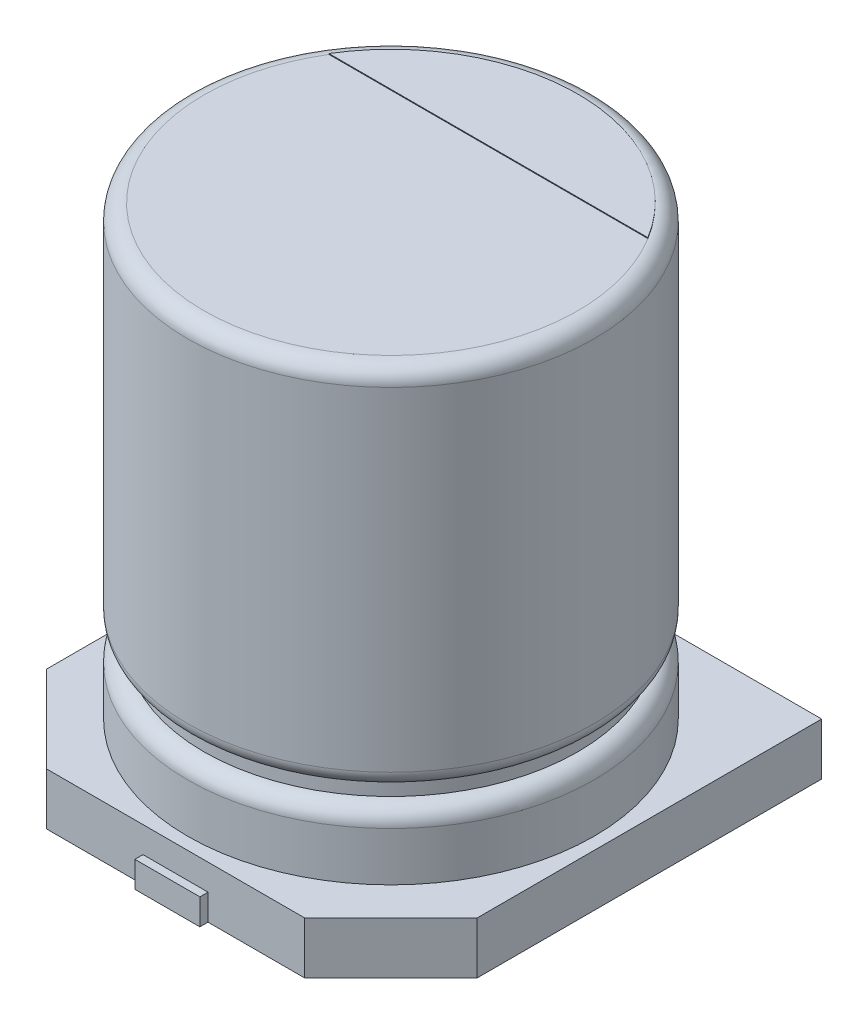
ISO-10303-21;
HEADER;
FILE_DESCRIPTION(('STEP AP214'),'2;1');
FILE_NAME('part.step','',(''),(''),'','','');
FILE_SCHEMA(('AUTOMOTIVE_DESIGN { 1 0 10303 214 1 1 1 1 }'));
ENDSEC;
DATA;
#1=APPLICATION_CONTEXT('core data for automotive mechanical design processes');
#2=APPLICATION_PROTOCOL_DEFINITION('international standard','automotive_design',2000,#1);
#3=PRODUCT_CONTEXT('',#1,'mechanical');
#4=PRODUCT('Part','Part','',(#3));
#5=PRODUCT_RELATED_PRODUCT_CATEGORY('part','',(#4));
#6=PRODUCT_DEFINITION_FORMATION('','',#4);
#7=PRODUCT_DEFINITION_CONTEXT('part definition',#1,'design');
#8=PRODUCT_DEFINITION('design','',#6,#7);
#9=PRODUCT_DEFINITION_SHAPE('','',#8);
#10=(LENGTH_UNIT() NAMED_UNIT(*) SI_UNIT(.MILLI.,.METRE.));
#11=(NAMED_UNIT(*) PLANE_ANGLE_UNIT() SI_UNIT($,.RADIAN.));
#12=(NAMED_UNIT(*) SI_UNIT($,.STERADIAN.) SOLID_ANGLE_UNIT());
#13=UNCERTAINTY_MEASURE_WITH_UNIT(LENGTH_MEASURE(1.E-05),#10,'distance_accuracy_value','');
#14=(GEOMETRIC_REPRESENTATION_CONTEXT(3) GLOBAL_UNCERTAINTY_ASSIGNED_CONTEXT((#13)) GLOBAL_UNIT_ASSIGNED_CONTEXT((#10,
#11,#12)) REPRESENTATION_CONTEXT('',''));
#15=CARTESIAN_POINT('',(0.,0.,0.));
#16=DIRECTION('',(0.,0.,1.));
#17=DIRECTION('',(1.,0.,0.));
#18=AXIS2_PLACEMENT_3D('',#15,#16,#17);
#19=CARTESIAN_POINT('',(0.,-0.64,0.));
#20=DIRECTION('',(0.,-1.,0.));
#21=DIRECTION('',(1.,0.,0.));
#22=AXIS2_PLACEMENT_3D('',#19,#20,#21);
#23=PLANE('',#22);
#24=DIRECTION('',(-1.,0.,0.));
#25=VECTOR('',#24,1.);
#26=CARTESIAN_POINT('',(1.58933982822018,-0.64,2.65));
#27=LINE('',#26,#25);
#28=CARTESIAN_POINT('',(1.58933982822018,-0.64,2.65));
#29=VERTEX_POINT('',#28);
#30=CARTESIAN_POINT('',(0.4,-0.64,2.65));
#31=VERTEX_POINT('',#30);
#32=EDGE_CURVE('E238',#29,#31,#27,.T.);
#33=ORIENTED_EDGE('',*,*,#32,.T.);
#34=DIRECTION('',(0.,0.,-1.));
#35=VECTOR('',#34,1.);
#36=CARTESIAN_POINT('',(0.4,-0.64,0.));
#37=LINE('',#36,#35);
#38=CARTESIAN_POINT('',(0.4,-0.64,0.5));
#39=VERTEX_POINT('',#38);
#40=EDGE_CURVE('E11',#31,#39,#37,.T.);
#41=ORIENTED_EDGE('',*,*,#40,.T.);
#42=DIRECTION('',(-1.,0.,0.));
#43=VECTOR('',#42,1.);
#44=CARTESIAN_POINT('',(0.,-0.64,0.5));
#45=LINE('',#44,#43);
#46=CARTESIAN_POINT('',(-0.4,-0.64,0.5));
#47=VERTEX_POINT('',#46);
#48=EDGE_CURVE('E45',#39,#47,#45,.T.);
#49=ORIENTED_EDGE('',*,*,#48,.T.);
#50=DIRECTION('',(0.,0.,1.));
#51=VECTOR('',#50,1.);
#52=CARTESIAN_POINT('',(-0.4,-0.64,0.));
#53=LINE('',#52,#51);
#54=CARTESIAN_POINT('',(-0.4,-0.64,2.65));
#55=VERTEX_POINT('',#54);
#56=EDGE_CURVE('E317',#47,#55,#53,.T.);
#57=ORIENTED_EDGE('',*,*,#56,.T.);
#58=CARTESIAN_POINT('',(-1.58933982822018,-0.64,2.65));
#59=VERTEX_POINT('',#58);
#60=EDGE_CURVE('E237',#55,#59,#27,.T.);
#61=ORIENTED_EDGE('',*,*,#60,.T.);
#62=DIRECTION('',(-0.707106781186546,0.,-0.707106781186549));
#63=VECTOR('',#62,1.);
#64=CARTESIAN_POINT('',(-1.58933982822018,-0.64,2.65));
#65=LINE('',#64,#63);
#66=CARTESIAN_POINT('',(-2.65,-0.64,1.58933982822018));
#67=VERTEX_POINT('',#66);
#68=EDGE_CURVE('E240',#59,#67,#65,.T.);
#69=ORIENTED_EDGE('',*,*,#68,.T.);
#70=DIRECTION('',(0.,0.,-1.));
#71=VECTOR('',#70,1.);
#72=CARTESIAN_POINT('',(-2.65,-0.64,1.58933982822018));
#73=LINE('',#72,#71);
#74=CARTESIAN_POINT('',(-2.65,-0.64,-2.65));
#75=VERTEX_POINT('',#74);
#76=EDGE_CURVE('E225',#67,#75,#73,.T.);
#77=ORIENTED_EDGE('',*,*,#76,.T.);
#78=DIRECTION('',(1.,0.,0.));
#79=VECTOR('',#78,1.);
#80=CARTESIAN_POINT('',(-2.65,-0.64,-2.65));
#81=LINE('',#80,#79);
#82=CARTESIAN_POINT('',(-0.4,-0.64,-2.65));
#83=VERTEX_POINT('',#82);
#84=EDGE_CURVE('E230',#75,#83,#81,.T.);
#85=ORIENTED_EDGE('',*,*,#84,.T.);
#86=DIRECTION('',(0.,0.,1.));
#87=VECTOR('',#86,1.);
#88=CARTESIAN_POINT('',(-0.4,-0.64,0.));
#89=LINE('',#88,#87);
#90=CARTESIAN_POINT('',(-0.4,-0.64,-0.5));
#91=VERTEX_POINT('',#90);
#92=EDGE_CURVE('E314',#83,#91,#89,.T.);
#93=ORIENTED_EDGE('',*,*,#92,.T.);
#94=DIRECTION('',(1.,0.,0.));
#95=VECTOR('',#94,1.);
#96=CARTESIAN_POINT('',(0.,-0.64,-0.5));
#97=LINE('',#96,#95);
#98=CARTESIAN_POINT('',(0.4,-0.64,-0.5));
#99=VERTEX_POINT('',#98);
#100=EDGE_CURVE('E307',#91,#99,#97,.T.);
#101=ORIENTED_EDGE('',*,*,#100,.T.);
#102=DIRECTION('',(0.,0.,-1.));
#103=VECTOR('',#102,1.);
#104=CARTESIAN_POINT('',(0.4,-0.64,0.));
#105=LINE('',#104,#103);
#106=CARTESIAN_POINT('',(0.4,-0.64,-2.65));
#107=VERTEX_POINT('',#106);
#108=EDGE_CURVE('E311',#99,#107,#105,.T.);
#109=ORIENTED_EDGE('',*,*,#108,.T.);
#110=CARTESIAN_POINT('',(2.65,-0.64,-2.65));
#111=VERTEX_POINT('',#110);
#112=EDGE_CURVE('E228',#107,#111,#81,.T.);
#113=ORIENTED_EDGE('',*,*,#112,.T.);
#114=DIRECTION('',(0.,0.,1.));
#115=VECTOR('',#114,1.);
#116=CARTESIAN_POINT('',(2.65,-0.64,-2.65));
#117=LINE('',#116,#115);
#118=CARTESIAN_POINT('',(2.65,-0.64,1.58933982822018));
#119=VERTEX_POINT('',#118);
#120=EDGE_CURVE('E233',#111,#119,#117,.T.);
#121=ORIENTED_EDGE('',*,*,#120,.T.);
#122=DIRECTION('',(-0.707106781186546,0.,0.707106781186549));
#123=VECTOR('',#122,1.);
#124=CARTESIAN_POINT('',(2.65,-0.64,1.58933982822018));
#125=LINE('',#124,#123);
#126=EDGE_CURVE('E235',#119,#29,#125,.T.);
#127=ORIENTED_EDGE('',*,*,#126,.T.);
#128=EDGE_LOOP('',(#33,#41,#49,#57,#61,#69,#77,#85,#93,#101,#109,#113,#121,#127));
#129=FACE_BOUND('',#128,.T.);
#130=ADVANCED_FACE('F36',(#129),#23,.T.);
#131=ORIENTED_EDGE('',*,*,#40,.F.);
#132=DIRECTION('',(0.,0.,1.));
#133=VECTOR('',#132,1.);
#134=CARTESIAN_POINT('',(0.4,-0.64,0.5));
#135=LINE('',#134,#133);
#136=CARTESIAN_POINT('',(0.4,-0.64,2.75));
#137=VERTEX_POINT('',#136);
#138=EDGE_CURVE('E156',#31,#137,#135,.T.);
#139=ORIENTED_EDGE('',*,*,#138,.T.);
#140=DIRECTION('',(-1.,0.,0.));
#141=VECTOR('',#140,1.);
#142=CARTESIAN_POINT('',(-0.4,-0.64,2.75));
#143=LINE('',#142,#141);
#144=CARTESIAN_POINT('',(-0.4,-0.64,2.75));
#145=VERTEX_POINT('',#144);
#146=EDGE_CURVE('E161',#137,#145,#143,.T.);
#147=ORIENTED_EDGE('',*,*,#146,.T.);
#148=DIRECTION('',(0.,0.,-1.));
#149=VECTOR('',#148,1.);
#150=CARTESIAN_POINT('',(-0.4,-0.64,0.5));
#151=LINE('',#150,#149);
#152=EDGE_CURVE('E180',#145,#55,#151,.T.);
#153=ORIENTED_EDGE('',*,*,#152,.T.);
#154=ORIENTED_EDGE('',*,*,#56,.F.);
#155=ORIENTED_EDGE('',*,*,#48,.F.);
#156=EDGE_LOOP('',(#131,#139,#147,#153,#154,#155));
#157=FACE_BOUND('',#156,.T.);
#158=ADVANCED_FACE('F158',(#157),#23,.T.);
#159=ORIENTED_EDGE('',*,*,#92,.F.);
#160=DIRECTION('',(0.,0.,-1.));
#161=VECTOR('',#160,1.);
#162=CARTESIAN_POINT('',(-0.4,-0.64,-0.5));
#163=LINE('',#162,#161);
#164=CARTESIAN_POINT('',(-0.4,-0.64,-2.75));
#165=VERTEX_POINT('',#164);
#166=EDGE_CURVE('E190',#83,#165,#163,.T.);
#167=ORIENTED_EDGE('',*,*,#166,.T.);
#168=DIRECTION('',(1.,0.,0.));
#169=VECTOR('',#168,1.);
#170=CARTESIAN_POINT('',(-0.4,-0.64,-2.75));
#171=LINE('',#170,#169);
#172=CARTESIAN_POINT('',(0.4,-0.64,-2.75));
#173=VERTEX_POINT('',#172);
#174=EDGE_CURVE('E192',#165,#173,#171,.T.);
#175=ORIENTED_EDGE('',*,*,#174,.T.);
#176=DIRECTION('',(0.,0.,1.));
#177=VECTOR('',#176,1.);
#178=CARTESIAN_POINT('',(0.4,-0.64,-0.5));
#179=LINE('',#178,#177);
#180=EDGE_CURVE('E195',#173,#107,#179,.T.);
#181=ORIENTED_EDGE('',*,*,#180,.T.);
#182=ORIENTED_EDGE('',*,*,#108,.F.);
#183=ORIENTED_EDGE('',*,*,#100,.F.);
#184=EDGE_LOOP('',(#159,#167,#175,#181,#182,#183));
#185=FACE_BOUND('',#184,.T.);
#186=ADVANCED_FACE('F372',(#185),#23,.T.);
#187=CARTESIAN_POINT('',(1.58933982822018,-0.64,2.65));
#188=DIRECTION('',(0.,0.,-1.));
#189=DIRECTION('',(-1.,0.,0.));
#190=AXIS2_PLACEMENT_3D('',#187,#188,#189);
#191=PLANE('',#190);
#192=DIRECTION('',(0.,-1.,0.));
#193=VECTOR('',#192,1.);
#194=CARTESIAN_POINT('',(-0.399999999999999,-0.32,2.65));
#195=LINE('',#194,#193);
#196=CARTESIAN_POINT('',(-0.4,-0.32,2.65));
#197=VERTEX_POINT('',#196);
#198=EDGE_CURVE('E212',#197,#55,#195,.T.);
#199=ORIENTED_EDGE('',*,*,#198,.F.);
#200=DIRECTION('',(-1.,0.,0.));
#201=VECTOR('',#200,1.);
#202=CARTESIAN_POINT('',(0.,-0.32,2.65));
#203=LINE('',#202,#201);
#204=CARTESIAN_POINT('',(0.4,-0.32,2.65));
#205=VERTEX_POINT('',#204);
#206=EDGE_CURVE('E209',#205,#197,#203,.T.);
#207=ORIENTED_EDGE('',*,*,#206,.F.);
#208=DIRECTION('',(0.,-1.,0.));
#209=VECTOR('',#208,1.);
#210=CARTESIAN_POINT('',(0.399999999999999,-0.32,2.65));
#211=LINE('',#210,#209);
#212=EDGE_CURVE('E211',#205,#31,#211,.T.);
#213=ORIENTED_EDGE('',*,*,#212,.T.);
#214=ORIENTED_EDGE('',*,*,#32,.F.);
#215=DIRECTION('',(0.,1.,0.));
#216=VECTOR('',#215,1.);
#217=CARTESIAN_POINT('',(1.58933982822018,-0.64,2.65));
#218=LINE('',#217,#216);
#219=CARTESIAN_POINT('',(1.58933982822018,0.,2.65));
#220=VERTEX_POINT('',#219);
#221=EDGE_CURVE('E259',#29,#220,#218,.T.);
#222=ORIENTED_EDGE('',*,*,#221,.T.);
#223=DIRECTION('',(-1.,0.,0.));
#224=VECTOR('',#223,1.);
#225=CARTESIAN_POINT('',(1.58933982822018,0.,2.65));
#226=LINE('',#225,#224);
#227=CARTESIAN_POINT('',(-1.58933982822018,0.,2.65));
#228=VERTEX_POINT('',#227);
#229=EDGE_CURVE('E251',#220,#228,#226,.T.);
#230=ORIENTED_EDGE('',*,*,#229,.T.);
#231=DIRECTION('',(0.,1.,0.));
#232=VECTOR('',#231,1.);
#233=CARTESIAN_POINT('',(-1.58933982822018,-0.64,2.65));
#234=LINE('',#233,#232);
#235=EDGE_CURVE('E256',#59,#228,#234,.T.);
#236=ORIENTED_EDGE('',*,*,#235,.F.);
#237=ORIENTED_EDGE('',*,*,#60,.F.);
#238=EDGE_LOOP('',(#199,#207,#213,#214,#222,#230,#236,#237));
#239=FACE_BOUND('',#238,.T.);
#240=ADVANCED_FACE('F340',(#239),#191,.F.);
#241=CARTESIAN_POINT('',(-2.65,-0.64,-2.65));
#242=DIRECTION('',(0.,0.,1.));
#243=DIRECTION('',(1.,0.,0.));
#244=AXIS2_PLACEMENT_3D('',#241,#242,#243);
#245=PLANE('',#244);
#246=DIRECTION('',(0.,-1.,0.));
#247=VECTOR('',#246,1.);
#248=CARTESIAN_POINT('',(0.399999999999999,-0.32,-2.65));
#249=LINE('',#248,#247);
#250=CARTESIAN_POINT('',(0.4,-0.32,-2.65));
#251=VERTEX_POINT('',#250);
#252=EDGE_CURVE('E219',#251,#107,#249,.T.);
#253=ORIENTED_EDGE('',*,*,#252,.F.);
#254=DIRECTION('',(1.,0.,0.));
#255=VECTOR('',#254,1.);
#256=CARTESIAN_POINT('',(0.,-0.32,-2.65));
#257=LINE('',#256,#255);
#258=CARTESIAN_POINT('',(-0.4,-0.32,-2.65));
#259=VERTEX_POINT('',#258);
#260=EDGE_CURVE('E215',#259,#251,#257,.T.);
#261=ORIENTED_EDGE('',*,*,#260,.F.);
#262=DIRECTION('',(0.,-1.,0.));
#263=VECTOR('',#262,1.);
#264=CARTESIAN_POINT('',(-0.399999999999999,-0.32,-2.65));
#265=LINE('',#264,#263);
#266=EDGE_CURVE('E218',#259,#83,#265,.T.);
#267=ORIENTED_EDGE('',*,*,#266,.T.);
#268=ORIENTED_EDGE('',*,*,#84,.F.);
#269=DIRECTION('',(0.,1.,0.));
#270=VECTOR('',#269,1.);
#271=CARTESIAN_POINT('',(-2.65,-0.64,-2.65));
#272=LINE('',#271,#270);
#273=CARTESIAN_POINT('',(-2.65,0.,-2.65));
#274=VERTEX_POINT('',#273);
#275=EDGE_CURVE('E268',#75,#274,#272,.T.);
#276=ORIENTED_EDGE('',*,*,#275,.T.);
#277=DIRECTION('',(1.,0.,0.));
#278=VECTOR('',#277,1.);
#279=CARTESIAN_POINT('',(-2.65,0.,-2.65));
#280=LINE('',#279,#278);
#281=CARTESIAN_POINT('',(2.65,0.,-2.65));
#282=VERTEX_POINT('',#281);
#283=EDGE_CURVE('E245',#274,#282,#280,.T.);
#284=ORIENTED_EDGE('',*,*,#283,.T.);
#285=DIRECTION('',(0.,1.,0.));
#286=VECTOR('',#285,1.);
#287=CARTESIAN_POINT('',(2.65,-0.64,-2.65));
#288=LINE('',#287,#286);
#289=EDGE_CURVE('E265',#111,#282,#288,.T.);
#290=ORIENTED_EDGE('',*,*,#289,.F.);
#291=ORIENTED_EDGE('',*,*,#112,.F.);
#292=EDGE_LOOP('',(#253,#261,#267,#268,#276,#284,#290,#291));
#293=FACE_BOUND('',#292,.T.);
#294=ADVANCED_FACE('F354',(#293),#245,.F.);
#295=CARTESIAN_POINT('',(0.,5.5,0.));
#296=DIRECTION('',(0.,1.,0.));
#297=DIRECTION('',(-1.,0.,0.));
#298=AXIS2_PLACEMENT_3D('',#295,#296,#297);
#299=PLANE('',#298);
#300=CARTESIAN_POINT('',(0.,5.5,0.));
#301=DIRECTION('',(0.,1.,0.));
#302=DIRECTION('',(-1.,0.,0.));
#303=AXIS2_PLACEMENT_3D('',#300,#301,#302);
#304=CIRCLE('',#303,2.3);
#305=CARTESIAN_POINT('',(-1.96214168703486,5.5,-1.2));
#306=VERTEX_POINT('',#305);
#307=CARTESIAN_POINT('',(1.96214168703486,5.5,-1.2));
#308=VERTEX_POINT('',#307);
#309=EDGE_CURVE('E303',#306,#308,#304,.T.);
#310=ORIENTED_EDGE('',*,*,#309,.T.);
#311=DIRECTION('',(1.,0.,0.));
#312=VECTOR('',#311,1.);
#313=CARTESIAN_POINT('',(-1.96214168703486,5.5,-1.2));
#314=LINE('',#313,#312);
#315=EDGE_CURVE('E274',#306,#308,#314,.T.);
#316=ORIENTED_EDGE('',*,*,#315,.F.);
#317=EDGE_LOOP('',(#310,#316));
#318=FACE_BOUND('',#317,.T.);
#319=ADVANCED_FACE('F38',(#318),#299,.T.);
#320=CARTESIAN_POINT('',(0.,5.3,0.));
#321=DIRECTION('',(0.,1.,0.));
#322=DIRECTION('',(-1.,0.,0.));
#323=AXIS2_PLACEMENT_3D('',#320,#321,#322);
#324=TOROIDAL_SURFACE('',#323,2.3,0.2);
#325=CARTESIAN_POINT('',(0.,5.3,0.));
#326=DIRECTION('',(0.,1.,0.));
#327=DIRECTION('',(-1.,0.,0.));
#328=AXIS2_PLACEMENT_3D('',#325,#326,#327);
#329=CIRCLE('',#328,2.5);
#330=CARTESIAN_POINT('',(-2.5,5.3,0.));
#331=VERTEX_POINT('',#330);
#332=EDGE_CURVE('E300',#331,#331,#329,.T.);
#333=ORIENTED_EDGE('',*,*,#332,.T.);
#334=EDGE_LOOP('',(#333));
#335=FACE_BOUND('',#334,.T.);
#336=EDGE_CURVE('E304',#308,#306,#304,.T.);
#337=ORIENTED_EDGE('',*,*,#336,.F.);
#338=ORIENTED_EDGE('',*,*,#309,.F.);
#339=EDGE_LOOP('',(#337,#338));
#340=FACE_BOUND('',#339,.T.);
#341=ADVANCED_FACE('F453',(#335,#340),#324,.T.);
#342=CARTESIAN_POINT('',(0.,8.08222988146831,0.));
#343=DIRECTION('',(0.,1.,0.));
#344=DIRECTION('',(-1.,0.,0.));
#345=AXIS2_PLACEMENT_3D('',#342,#343,#344);
#346=CYLINDRICAL_SURFACE('',#345,2.5);
#347=CARTESIAN_POINT('',(0.,1.2,0.));
#348=DIRECTION('',(0.,1.,0.));
#349=DIRECTION('',(-1.,0.,0.));
#350=AXIS2_PLACEMENT_3D('',#347,#348,#349);
#351=CIRCLE('',#350,2.5);
#352=CARTESIAN_POINT('',(-2.5,1.2,0.));
#353=VERTEX_POINT('',#352);
#354=EDGE_CURVE('E297',#353,#353,#351,.T.);
#355=ORIENTED_EDGE('',*,*,#354,.T.);
#356=EDGE_LOOP('',(#355));
#357=FACE_BOUND('',#356,.T.);
#358=ORIENTED_EDGE('',*,*,#332,.F.);
#359=EDGE_LOOP('',(#358));
#360=FACE_BOUND('',#359,.T.);
#361=ADVANCED_FACE('F450',(#357,#360),#346,.T.);
#362=CARTESIAN_POINT('',(0.,1.2,0.));
#363=DIRECTION('',(0.,1.,0.));
#364=DIRECTION('',(-1.,0.,0.));
#365=AXIS2_PLACEMENT_3D('',#362,#363,#364);
#366=TOROIDAL_SURFACE('',#365,2.3,0.2);
#367=CARTESIAN_POINT('',(0.,0.999999999999999,0.));
#368=DIRECTION('',(0.,1.,0.));
#369=DIRECTION('',(-1.,0.,0.));
#370=AXIS2_PLACEMENT_3D('',#367,#368,#369);
#371=CIRCLE('',#370,2.3);
#372=CARTESIAN_POINT('',(-2.3,0.999999999999999,0.));
#373=VERTEX_POINT('',#372);
#374=EDGE_CURVE('E294',#373,#373,#371,.T.);
#375=ORIENTED_EDGE('',*,*,#374,.T.);
#376=EDGE_LOOP('',(#375));
#377=FACE_BOUND('',#376,.T.);
#378=ORIENTED_EDGE('',*,*,#354,.F.);
#379=EDGE_LOOP('',(#378));
#380=FACE_BOUND('',#379,.T.);
#381=ADVANCED_FACE('F446',(#377,#380),#366,.T.);
#382=CARTESIAN_POINT('',(0.,8.08222988146831,0.));
#383=DIRECTION('',(0.,1.,0.));
#384=DIRECTION('',(-1.,0.,0.));
#385=AXIS2_PLACEMENT_3D('',#382,#383,#384);
#386=CYLINDRICAL_SURFACE('',#385,2.3);
#387=CARTESIAN_POINT('',(0.,0.799999999999999,0.));
#388=DIRECTION('',(0.,1.,0.));
#389=DIRECTION('',(-1.,0.,0.));
#390=AXIS2_PLACEMENT_3D('',#387,#388,#389);
#391=CIRCLE('',#390,2.3);
#392=CARTESIAN_POINT('',(-2.3,0.799999999999999,0.));
#393=VERTEX_POINT('',#392);
#394=EDGE_CURVE('E291',#393,#393,#391,.T.);
#395=ORIENTED_EDGE('',*,*,#394,.T.);
#396=EDGE_LOOP('',(#395));
#397=FACE_BOUND('',#396,.T.);
#398=ORIENTED_EDGE('',*,*,#374,.F.);
#399=EDGE_LOOP('',(#398));
#400=FACE_BOUND('',#399,.T.);
#401=ADVANCED_FACE('F442',(#397,#400),#386,.T.);
#402=CARTESIAN_POINT('',(0.,0.599999999999999,0.));
#403=DIRECTION('',(0.,1.,0.));
#404=DIRECTION('',(-1.,0.,0.));
#405=AXIS2_PLACEMENT_3D('',#402,#403,#404);
#406=TOROIDAL_SURFACE('',#405,2.3,0.2);
#407=CARTESIAN_POINT('',(0.,0.6,0.));
#408=DIRECTION('',(0.,1.,0.));
#409=DIRECTION('',(-1.,0.,0.));
#410=AXIS2_PLACEMENT_3D('',#407,#408,#409);
#411=CIRCLE('',#410,2.5);
#412=CARTESIAN_POINT('',(-2.5,0.6,0.));
#413=VERTEX_POINT('',#412);
#414=EDGE_CURVE('E288',#413,#413,#411,.T.);
#415=ORIENTED_EDGE('',*,*,#414,.T.);
#416=EDGE_LOOP('',(#415));
#417=FACE_BOUND('',#416,.T.);
#418=ORIENTED_EDGE('',*,*,#394,.F.);
#419=EDGE_LOOP('',(#418));
#420=FACE_BOUND('',#419,.T.);
#421=ADVANCED_FACE('F438',(#417,#420),#406,.T.);
#422=CARTESIAN_POINT('',(0.,8.08222988146831,0.));
#423=DIRECTION('',(0.,1.,0.));
#424=DIRECTION('',(-1.,0.,0.));
#425=AXIS2_PLACEMENT_3D('',#422,#423,#424);
#426=CYLINDRICAL_SURFACE('',#425,2.5);
#427=CARTESIAN_POINT('',(0.,0.,0.));
#428=DIRECTION('',(0.,-1.,0.));
#429=DIRECTION('',(1.,0.,0.));
#430=AXIS2_PLACEMENT_3D('',#427,#428,#429);
#431=CIRCLE('',#430,2.5);
#432=CARTESIAN_POINT('',(2.5,0.,0.));
#433=VERTEX_POINT('',#432);
#434=EDGE_CURVE('E271',#433,#433,#431,.F.);
#435=ORIENTED_EDGE('',*,*,#434,.T.);
#436=EDGE_LOOP('',(#435));
#437=FACE_BOUND('',#436,.T.);
#438=ORIENTED_EDGE('',*,*,#414,.F.);
#439=EDGE_LOOP('',(#438));
#440=FACE_BOUND('',#439,.T.);
#441=ADVANCED_FACE('F434',(#437,#440),#426,.T.);
#442=CARTESIAN_POINT('',(0.,5.51,0.));
#443=DIRECTION('',(0.,-1.,0.));
#444=DIRECTION('',(1.,0.,0.));
#445=AXIS2_PLACEMENT_3D('',#442,#443,#444);
#446=CYLINDRICAL_SURFACE('',#445,2.3);
#447=ORIENTED_EDGE('',*,*,#336,.T.);
#448=DIRECTION('',(0.,-1.,0.));
#449=VECTOR('',#448,1.);
#450=CARTESIAN_POINT('',(-1.96214168703486,5.51,-1.2));
#451=LINE('',#450,#449);
#452=CARTESIAN_POINT('',(-1.96214168703486,5.51,-1.2));
#453=VERTEX_POINT('',#452);
#454=EDGE_CURVE('E285',#453,#306,#451,.T.);
#455=ORIENTED_EDGE('',*,*,#454,.F.);
#456=CARTESIAN_POINT('',(0.,5.51,0.));
#457=DIRECTION('',(0.,1.,0.));
#458=DIRECTION('',(-1.,0.,0.));
#459=AXIS2_PLACEMENT_3D('',#456,#457,#458);
#460=CIRCLE('',#459,2.3);
#461=CARTESIAN_POINT('',(1.96214168703486,5.51,-1.2));
#462=VERTEX_POINT('',#461);
#463=EDGE_CURVE('E275',#462,#453,#460,.T.);
#464=ORIENTED_EDGE('',*,*,#463,.F.);
#465=DIRECTION('',(0.,-1.,0.));
#466=VECTOR('',#465,1.);
#467=CARTESIAN_POINT('',(1.96214168703486,5.51,-1.2));
#468=LINE('',#467,#466);
#469=EDGE_CURVE('E280',#462,#308,#468,.T.);
#470=ORIENTED_EDGE('',*,*,#469,.T.);
#471=EDGE_LOOP('',(#447,#455,#464,#470));
#472=FACE_BOUND('',#471,.T.);
#473=ADVANCED_FACE('F430',(#472),#446,.T.);
#474=CARTESIAN_POINT('',(-1.96214168703486,5.51,-1.2));
#475=DIRECTION('',(0.,0.,-1.));
#476=DIRECTION('',(-1.,0.,0.));
#477=AXIS2_PLACEMENT_3D('',#474,#475,#476);
#478=PLANE('',#477);
#479=ORIENTED_EDGE('',*,*,#315,.T.);
#480=ORIENTED_EDGE('',*,*,#469,.F.);
#481=DIRECTION('',(1.,0.,0.));
#482=VECTOR('',#481,1.);
#483=CARTESIAN_POINT('',(-1.96214168703486,5.51,-1.2));
#484=LINE('',#483,#482);
#485=EDGE_CURVE('E278',#453,#462,#484,.T.);
#486=ORIENTED_EDGE('',*,*,#485,.F.);
#487=ORIENTED_EDGE('',*,*,#454,.T.);
#488=EDGE_LOOP('',(#479,#480,#486,#487));
#489=FACE_BOUND('',#488,.T.);
#490=ADVANCED_FACE('F426',(#489),#478,.F.);
#491=CARTESIAN_POINT('',(0.,5.51,0.));
#492=DIRECTION('',(0.,1.,0.));
#493=DIRECTION('',(-1.,0.,0.));
#494=AXIS2_PLACEMENT_3D('',#491,#492,#493);
#495=PLANE('',#494);
#496=ORIENTED_EDGE('',*,*,#463,.T.);
#497=ORIENTED_EDGE('',*,*,#485,.T.);
#498=EDGE_LOOP('',(#496,#497));
#499=FACE_BOUND('',#498,.T.);
#500=ADVANCED_FACE('F423',(#499),#495,.T.);
#501=CARTESIAN_POINT('',(-2.65,-0.64,1.58933982822018));
#502=DIRECTION('',(1.,0.,0.));
#503=DIRECTION('',(0.,0.,-1.));
#504=AXIS2_PLACEMENT_3D('',#501,#502,#503);
#505=PLANE('',#504);
#506=DIRECTION('',(0.,0.,-1.));
#507=VECTOR('',#506,1.);
#508=CARTESIAN_POINT('',(-2.65,0.,1.58933982822018));
#509=LINE('',#508,#507);
#510=CARTESIAN_POINT('',(-2.65,0.,1.58933982822018));
#511=VERTEX_POINT('',#510);
#512=EDGE_CURVE('E222',#511,#274,#509,.T.);
#513=ORIENTED_EDGE('',*,*,#512,.T.);
#514=ORIENTED_EDGE('',*,*,#275,.F.);
#515=ORIENTED_EDGE('',*,*,#76,.F.);
#516=DIRECTION('',(0.,1.,0.));
#517=VECTOR('',#516,1.);
#518=CARTESIAN_POINT('',(-2.65,-0.64,1.58933982822018));
#519=LINE('',#518,#517);
#520=EDGE_CURVE('E242',#67,#511,#519,.T.);
#521=ORIENTED_EDGE('',*,*,#520,.T.);
#522=EDGE_LOOP('',(#513,#514,#515,#521));
#523=FACE_BOUND('',#522,.T.);
#524=ADVANCED_FACE('F350',(#523),#505,.F.);
#525=CARTESIAN_POINT('',(2.65,-0.64,-2.65));
#526=DIRECTION('',(-1.,0.,0.));
#527=DIRECTION('',(0.,0.,1.));
#528=AXIS2_PLACEMENT_3D('',#525,#526,#527);
#529=PLANE('',#528);
#530=DIRECTION('',(0.,0.,1.));
#531=VECTOR('',#530,1.);
#532=CARTESIAN_POINT('',(2.65,0.,-2.65));
#533=LINE('',#532,#531);
#534=CARTESIAN_POINT('',(2.65,0.,1.58933982822018));
#535=VERTEX_POINT('',#534);
#536=EDGE_CURVE('E247',#282,#535,#533,.T.);
#537=ORIENTED_EDGE('',*,*,#536,.T.);
#538=DIRECTION('',(0.,1.,0.));
#539=VECTOR('',#538,1.);
#540=CARTESIAN_POINT('',(2.65,-0.64,1.58933982822018));
#541=LINE('',#540,#539);
#542=EDGE_CURVE('E262',#119,#535,#541,.T.);
#543=ORIENTED_EDGE('',*,*,#542,.F.);
#544=ORIENTED_EDGE('',*,*,#120,.F.);
#545=ORIENTED_EDGE('',*,*,#289,.T.);
#546=EDGE_LOOP('',(#537,#543,#544,#545));
#547=FACE_BOUND('',#546,.T.);
#548=ADVANCED_FACE('F381',(#547),#529,.F.);
#549=CARTESIAN_POINT('',(2.65,-0.64,1.58933982822018));
#550=DIRECTION('',(-0.707106781186549,0.,-0.707106781186546));
#551=DIRECTION('',(-0.707106781186546,0.,0.707106781186549));
#552=AXIS2_PLACEMENT_3D('',#549,#550,#551);
#553=PLANE('',#552);
#554=DIRECTION('',(-0.707106781186546,0.,0.707106781186549));
#555=VECTOR('',#554,1.);
#556=CARTESIAN_POINT('',(2.65,0.,1.58933982822018));
#557=LINE('',#556,#555);
#558=EDGE_CURVE('E249',#535,#220,#557,.T.);
#559=ORIENTED_EDGE('',*,*,#558,.T.);
#560=ORIENTED_EDGE('',*,*,#221,.F.);
#561=ORIENTED_EDGE('',*,*,#126,.F.);
#562=ORIENTED_EDGE('',*,*,#542,.T.);
#563=EDGE_LOOP('',(#559,#560,#561,#562));
#564=FACE_BOUND('',#563,.T.);
#565=ADVANCED_FACE('F386',(#564),#553,.F.);
#566=CARTESIAN_POINT('',(-1.58933982822018,-0.64,2.65));
#567=DIRECTION('',(0.707106781186549,0.,-0.707106781186546));
#568=DIRECTION('',(-0.707106781186546,0.,-0.707106781186549));
#569=AXIS2_PLACEMENT_3D('',#566,#567,#568);
#570=PLANE('',#569);
#571=DIRECTION('',(-0.707106781186546,0.,-0.707106781186549));
#572=VECTOR('',#571,1.);
#573=CARTESIAN_POINT('',(-1.58933982822018,0.,2.65));
#574=LINE('',#573,#572);
#575=EDGE_CURVE('E229',#228,#511,#574,.T.);
#576=ORIENTED_EDGE('',*,*,#575,.T.);
#577=ORIENTED_EDGE('',*,*,#520,.F.);
#578=ORIENTED_EDGE('',*,*,#68,.F.);
#579=ORIENTED_EDGE('',*,*,#235,.T.);
#580=EDGE_LOOP('',(#576,#577,#578,#579));
#581=FACE_BOUND('',#580,.T.);
#582=ADVANCED_FACE('F346',(#581),#570,.F.);
#583=CARTESIAN_POINT('',(0.,0.,0.));
#584=DIRECTION('',(0.,-1.,0.));
#585=DIRECTION('',(1.,0.,0.));
#586=AXIS2_PLACEMENT_3D('',#583,#584,#585);
#587=PLANE('',#586);
#588=ORIENTED_EDGE('',*,*,#434,.F.);
#589=EDGE_LOOP('',(#588));
#590=FACE_BOUND('',#589,.T.);
#591=ORIENTED_EDGE('',*,*,#512,.F.);
#592=ORIENTED_EDGE('',*,*,#575,.F.);
#593=ORIENTED_EDGE('',*,*,#229,.F.);
#594=ORIENTED_EDGE('',*,*,#558,.F.);
#595=ORIENTED_EDGE('',*,*,#536,.F.);
#596=ORIENTED_EDGE('',*,*,#283,.F.);
#597=EDGE_LOOP('',(#591,#592,#593,#594,#595,#596));
#598=FACE_BOUND('',#597,.T.);
#599=ADVANCED_FACE('F489',(#590,#598),#587,.F.);
#600=CARTESIAN_POINT('',(0.,-0.32,0.));
#601=DIRECTION('',(0.,-1.,0.));
#602=DIRECTION('',(1.,0.,0.));
#603=AXIS2_PLACEMENT_3D('',#600,#601,#602);
#604=PLANE('',#603);
#605=DIRECTION('',(0.,0.,-1.));
#606=VECTOR('',#605,1.);
#607=CARTESIAN_POINT('',(-0.4,-0.32,-0.5));
#608=LINE('',#607,#606);
#609=CARTESIAN_POINT('',(-0.4,-0.32,-2.75));
#610=VERTEX_POINT('',#609);
#611=EDGE_CURVE('E174',#259,#610,#608,.T.);
#612=ORIENTED_EDGE('',*,*,#611,.F.);
#613=ORIENTED_EDGE('',*,*,#260,.T.);
#614=DIRECTION('',(0.,0.,1.));
#615=VECTOR('',#614,1.);
#616=CARTESIAN_POINT('',(0.4,-0.32,-0.5));
#617=LINE('',#616,#615);
#618=CARTESIAN_POINT('',(0.4,-0.32,-2.75));
#619=VERTEX_POINT('',#618);
#620=EDGE_CURVE('E193',#619,#251,#617,.T.);
#621=ORIENTED_EDGE('',*,*,#620,.F.);
#622=DIRECTION('',(1.,0.,0.));
#623=VECTOR('',#622,1.);
#624=CARTESIAN_POINT('',(-0.4,-0.32,-2.75));
#625=LINE('',#624,#623);
#626=EDGE_CURVE('E200',#610,#619,#625,.T.);
#627=ORIENTED_EDGE('',*,*,#626,.F.);
#628=EDGE_LOOP('',(#612,#613,#621,#627));
#629=FACE_BOUND('',#628,.T.);
#630=ADVANCED_FACE('F364',(#629),#604,.F.);
#631=CARTESIAN_POINT('',(-0.4,-0.64,-0.5));
#632=DIRECTION('',(1.,0.,0.));
#633=DIRECTION('',(0.,0.,-1.));
#634=AXIS2_PLACEMENT_3D('',#631,#632,#633);
#635=PLANE('',#634);
#636=ORIENTED_EDGE('',*,*,#166,.F.);
#637=ORIENTED_EDGE('',*,*,#266,.F.);
#638=ORIENTED_EDGE('',*,*,#611,.T.);
#639=DIRECTION('',(0.,1.,0.));
#640=VECTOR('',#639,1.);
#641=CARTESIAN_POINT('',(-0.4,-0.64,-2.75));
#642=LINE('',#641,#640);
#643=EDGE_CURVE('E206',#165,#610,#642,.T.);
#644=ORIENTED_EDGE('',*,*,#643,.F.);
#645=EDGE_LOOP('',(#636,#637,#638,#644));
#646=FACE_BOUND('',#645,.T.);
#647=ADVANCED_FACE('F360',(#646),#635,.F.);
#648=CARTESIAN_POINT('',(0.4,-0.64,-0.5));
#649=DIRECTION('',(-1.,0.,0.));
#650=DIRECTION('',(0.,0.,1.));
#651=AXIS2_PLACEMENT_3D('',#648,#649,#650);
#652=PLANE('',#651);
#653=ORIENTED_EDGE('',*,*,#620,.T.);
#654=ORIENTED_EDGE('',*,*,#252,.T.);
#655=ORIENTED_EDGE('',*,*,#180,.F.);
#656=DIRECTION('',(0.,1.,0.));
#657=VECTOR('',#656,1.);
#658=CARTESIAN_POINT('',(0.4,-0.64,-2.75));
#659=LINE('',#658,#657);
#660=EDGE_CURVE('E198',#173,#619,#659,.T.);
#661=ORIENTED_EDGE('',*,*,#660,.T.);
#662=EDGE_LOOP('',(#653,#654,#655,#661));
#663=FACE_BOUND('',#662,.T.);
#664=ADVANCED_FACE('F376',(#663),#652,.F.);
#665=CARTESIAN_POINT('',(-0.4,-0.64,-2.75));
#666=DIRECTION('',(0.,0.,1.));
#667=DIRECTION('',(0.,-1.,0.));
#668=AXIS2_PLACEMENT_3D('',#665,#666,#667);
#669=PLANE('',#668);
#670=ORIENTED_EDGE('',*,*,#626,.T.);
#671=ORIENTED_EDGE('',*,*,#660,.F.);
#672=ORIENTED_EDGE('',*,*,#174,.F.);
#673=ORIENTED_EDGE('',*,*,#643,.T.);
#674=EDGE_LOOP('',(#670,#671,#672,#673));
#675=FACE_BOUND('',#674,.T.);
#676=ADVANCED_FACE('F369',(#675),#669,.F.);
#677=CARTESIAN_POINT('',(0.,-0.32,0.));
#678=DIRECTION('',(0.,-1.,0.));
#679=DIRECTION('',(1.,0.,0.));
#680=AXIS2_PLACEMENT_3D('',#677,#678,#679);
#681=PLANE('',#680);
#682=DIRECTION('',(0.,0.,1.));
#683=VECTOR('',#682,1.);
#684=CARTESIAN_POINT('',(0.4,-0.32,0.5));
#685=LINE('',#684,#683);
#686=CARTESIAN_POINT('',(0.4,-0.32,2.75));
#687=VERTEX_POINT('',#686);
#688=EDGE_CURVE('E171',#205,#687,#685,.T.);
#689=ORIENTED_EDGE('',*,*,#688,.F.);
#690=ORIENTED_EDGE('',*,*,#206,.T.);
#691=DIRECTION('',(0.,0.,-1.));
#692=VECTOR('',#691,1.);
#693=CARTESIAN_POINT('',(-0.4,-0.32,0.5));
#694=LINE('',#693,#692);
#695=CARTESIAN_POINT('',(-0.4,-0.32,2.75));
#696=VERTEX_POINT('',#695);
#697=EDGE_CURVE('E165',#696,#197,#694,.T.);
#698=ORIENTED_EDGE('',*,*,#697,.F.);
#699=DIRECTION('',(-1.,0.,0.));
#700=VECTOR('',#699,1.);
#701=CARTESIAN_POINT('',(-0.4,-0.32,2.75));
#702=LINE('',#701,#700);
#703=EDGE_CURVE('E185',#687,#696,#702,.T.);
#704=ORIENTED_EDGE('',*,*,#703,.F.);
#705=EDGE_LOOP('',(#689,#690,#698,#704));
#706=FACE_BOUND('',#705,.T.);
#707=ADVANCED_FACE('F389',(#706),#681,.F.);
#708=CARTESIAN_POINT('',(0.4,-0.64,0.5));
#709=DIRECTION('',(-1.,0.,0.));
#710=DIRECTION('',(0.,0.,1.));
#711=AXIS2_PLACEMENT_3D('',#708,#709,#710);
#712=PLANE('',#711);
#713=ORIENTED_EDGE('',*,*,#138,.F.);
#714=ORIENTED_EDGE('',*,*,#212,.F.);
#715=ORIENTED_EDGE('',*,*,#688,.T.);
#716=DIRECTION('',(0.,1.,0.));
#717=VECTOR('',#716,1.);
#718=CARTESIAN_POINT('',(0.4,-0.64,2.75));
#719=LINE('',#718,#717);
#720=EDGE_CURVE('E168',#137,#687,#719,.T.);
#721=ORIENTED_EDGE('',*,*,#720,.F.);
#722=EDGE_LOOP('',(#713,#714,#715,#721));
#723=FACE_BOUND('',#722,.T.);
#724=ADVANCED_FACE('F169',(#723),#712,.F.);
#725=CARTESIAN_POINT('',(-0.4,-0.64,0.5));
#726=DIRECTION('',(1.,0.,0.));
#727=DIRECTION('',(0.,0.,-1.));
#728=AXIS2_PLACEMENT_3D('',#725,#726,#727);
#729=PLANE('',#728);
#730=ORIENTED_EDGE('',*,*,#697,.T.);
#731=ORIENTED_EDGE('',*,*,#198,.T.);
#732=ORIENTED_EDGE('',*,*,#152,.F.);
#733=DIRECTION('',(0.,1.,0.));
#734=VECTOR('',#733,1.);
#735=CARTESIAN_POINT('',(-0.4,-0.64,2.75));
#736=LINE('',#735,#734);
#737=EDGE_CURVE('E175',#145,#696,#736,.T.);
#738=ORIENTED_EDGE('',*,*,#737,.T.);
#739=EDGE_LOOP('',(#730,#731,#732,#738));
#740=FACE_BOUND('',#739,.T.);
#741=ADVANCED_FACE('F336',(#740),#729,.F.);
#742=CARTESIAN_POINT('',(-0.4,-0.64,2.75));
#743=DIRECTION('',(0.,0.,-1.));
#744=DIRECTION('',(0.,1.,0.));
#745=AXIS2_PLACEMENT_3D('',#742,#743,#744);
#746=PLANE('',#745);
#747=ORIENTED_EDGE('',*,*,#703,.T.);
#748=ORIENTED_EDGE('',*,*,#737,.F.);
#749=ORIENTED_EDGE('',*,*,#146,.F.);
#750=ORIENTED_EDGE('',*,*,#720,.T.);
#751=EDGE_LOOP('',(#747,#748,#749,#750));
#752=FACE_BOUND('',#751,.T.);
#753=ADVANCED_FACE('F177',(#752),#746,.F.);
#754=CLOSED_SHELL('',(#130,#158,#186,#240,#294,#319,#341,#361,#381,#401,#421,#441,#473,#490,
#500,#524,#548,#565,#582,#599,#630,#647,#664,#676,#707,#724,#741,#753));
#755=MANIFOLD_SOLID_BREP('B2',#754);
#756=ADVANCED_BREP_SHAPE_REPRESENTATION('',(#18,#755),#14);
#757=SHAPE_DEFINITION_REPRESENTATION(#9,#756);
ENDSEC;
END-ISO-10303-21;
